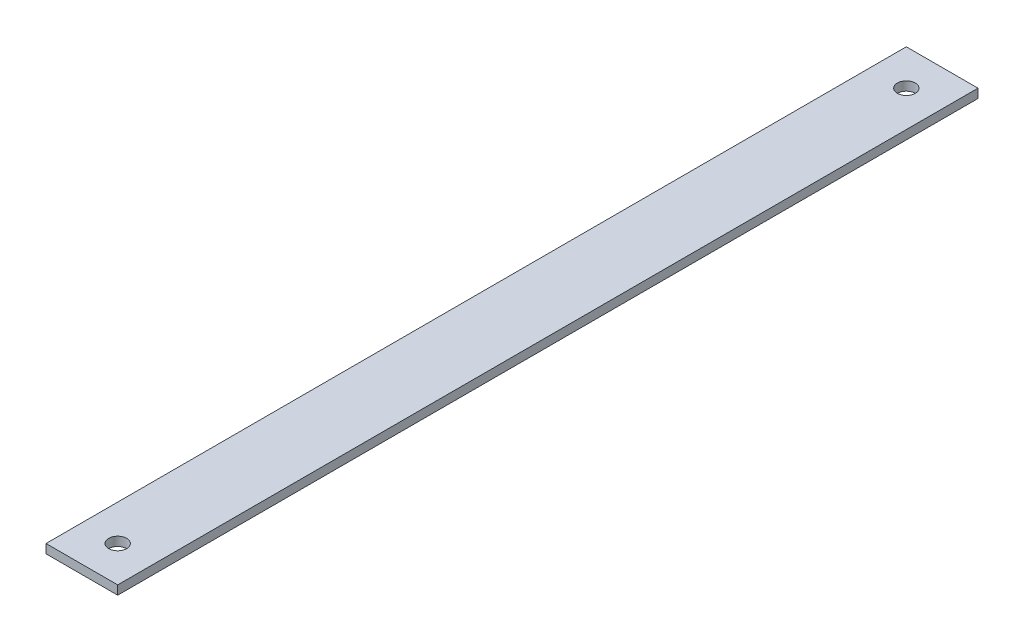
ISO-10303-21;
HEADER;
FILE_DESCRIPTION(('STEP AP214'),'2;1');
FILE_NAME('part.step','',(''),(''),'','','');
FILE_SCHEMA(('AUTOMOTIVE_DESIGN { 1 0 10303 214 1 1 1 1 }'));
ENDSEC;
DATA;
#1=APPLICATION_CONTEXT('core data for automotive mechanical design processes');
#2=APPLICATION_PROTOCOL_DEFINITION('international standard','automotive_design',2000,#1);
#3=PRODUCT_CONTEXT('',#1,'mechanical');
#4=PRODUCT('Part','Part','',(#3));
#5=PRODUCT_RELATED_PRODUCT_CATEGORY('part','',(#4));
#6=PRODUCT_DEFINITION_FORMATION('','',#4);
#7=PRODUCT_DEFINITION_CONTEXT('part definition',#1,'design');
#8=PRODUCT_DEFINITION('design','',#6,#7);
#9=PRODUCT_DEFINITION_SHAPE('','',#8);
#10=(LENGTH_UNIT() NAMED_UNIT(*) SI_UNIT(.MILLI.,.METRE.));
#11=(NAMED_UNIT(*) PLANE_ANGLE_UNIT() SI_UNIT($,.RADIAN.));
#12=(NAMED_UNIT(*) SI_UNIT($,.STERADIAN.) SOLID_ANGLE_UNIT());
#13=UNCERTAINTY_MEASURE_WITH_UNIT(LENGTH_MEASURE(1.E-05),#10,'distance_accuracy_value','');
#14=(GEOMETRIC_REPRESENTATION_CONTEXT(3) GLOBAL_UNCERTAINTY_ASSIGNED_CONTEXT((#13)) GLOBAL_UNIT_ASSIGNED_CONTEXT((#10,
#11,#12)) REPRESENTATION_CONTEXT('',''));
#15=CARTESIAN_POINT('',(0.,0.,0.));
#16=DIRECTION('',(0.,0.,1.));
#17=DIRECTION('',(1.,0.,0.));
#18=AXIS2_PLACEMENT_3D('',#15,#16,#17);
#19=CARTESIAN_POINT('',(-25.4,6.35,304.8));
#20=DIRECTION('',(1.,0.,0.));
#21=DIRECTION('',(0.,0.,-1.));
#22=AXIS2_PLACEMENT_3D('',#19,#20,#21);
#23=PLANE('',#22);
#24=DIRECTION('',(0.,0.,1.));
#25=VECTOR('',#24,1.);
#26=CARTESIAN_POINT('',(-25.4,0.,304.8));
#27=LINE('',#26,#25);
#28=CARTESIAN_POINT('',(-25.4,0.,-304.8));
#29=VERTEX_POINT('',#28);
#30=CARTESIAN_POINT('',(-25.4,0.,304.8));
#31=VERTEX_POINT('',#30);
#32=EDGE_CURVE('E96',#29,#31,#27,.T.);
#33=ORIENTED_EDGE('',*,*,#32,.T.);
#34=DIRECTION('',(0.,-1.,0.));
#35=VECTOR('',#34,1.);
#36=CARTESIAN_POINT('',(-25.4,6.35,304.8));
#37=LINE('',#36,#35);
#38=CARTESIAN_POINT('',(-25.4,6.35,304.8));
#39=VERTEX_POINT('',#38);
#40=EDGE_CURVE('E11',#39,#31,#37,.T.);
#41=ORIENTED_EDGE('',*,*,#40,.F.);
#42=DIRECTION('',(0.,0.,1.));
#43=VECTOR('',#42,1.);
#44=CARTESIAN_POINT('',(-25.4,6.35,304.8));
#45=LINE('',#44,#43);
#46=CARTESIAN_POINT('',(-25.4,6.35,-304.8));
#47=VERTEX_POINT('',#46);
#48=EDGE_CURVE('E84',#47,#39,#45,.T.);
#49=ORIENTED_EDGE('',*,*,#48,.F.);
#50=DIRECTION('',(0.,-1.,0.));
#51=VECTOR('',#50,1.);
#52=CARTESIAN_POINT('',(-25.4,6.35,-304.8));
#53=LINE('',#52,#51);
#54=EDGE_CURVE('E92',#47,#29,#53,.T.);
#55=ORIENTED_EDGE('',*,*,#54,.T.);
#56=EDGE_LOOP('',(#33,#41,#49,#55));
#57=FACE_BOUND('',#56,.T.);
#58=ADVANCED_FACE('F33',(#57),#23,.F.);
#59=CARTESIAN_POINT('',(25.4,6.35,304.8));
#60=DIRECTION('',(0.,0.,-1.));
#61=DIRECTION('',(-1.,0.,0.));
#62=AXIS2_PLACEMENT_3D('',#59,#60,#61);
#63=PLANE('',#62);
#64=DIRECTION('',(1.,0.,0.));
#65=VECTOR('',#64,1.);
#66=CARTESIAN_POINT('',(25.4,0.,304.8));
#67=LINE('',#66,#65);
#68=CARTESIAN_POINT('',(25.4,0.,304.8));
#69=VERTEX_POINT('',#68);
#70=EDGE_CURVE('E88',#31,#69,#67,.T.);
#71=ORIENTED_EDGE('',*,*,#70,.T.);
#72=DIRECTION('',(0.,-1.,0.));
#73=VECTOR('',#72,1.);
#74=CARTESIAN_POINT('',(25.4,6.35,304.8));
#75=LINE('',#74,#73);
#76=CARTESIAN_POINT('',(25.4,6.35,304.8));
#77=VERTEX_POINT('',#76);
#78=EDGE_CURVE('E41',#77,#69,#75,.T.);
#79=ORIENTED_EDGE('',*,*,#78,.F.);
#80=DIRECTION('',(1.,0.,0.));
#81=VECTOR('',#80,1.);
#82=CARTESIAN_POINT('',(25.4,6.35,304.8));
#83=LINE('',#82,#81);
#84=EDGE_CURVE('E79',#39,#77,#83,.T.);
#85=ORIENTED_EDGE('',*,*,#84,.F.);
#86=ORIENTED_EDGE('',*,*,#40,.T.);
#87=EDGE_LOOP('',(#71,#79,#85,#86));
#88=FACE_BOUND('',#87,.T.);
#89=ADVANCED_FACE('F87',(#88),#63,.F.);
#90=CARTESIAN_POINT('',(25.4,6.35,304.8));
#91=DIRECTION('',(-1.,0.,0.));
#92=DIRECTION('',(0.,0.,1.));
#93=AXIS2_PLACEMENT_3D('',#90,#91,#92);
#94=PLANE('',#93);
#95=DIRECTION('',(0.,0.,-1.));
#96=VECTOR('',#95,1.);
#97=CARTESIAN_POINT('',(25.4,0.,304.8));
#98=LINE('',#97,#96);
#99=CARTESIAN_POINT('',(25.4,0.,-304.8));
#100=VERTEX_POINT('',#99);
#101=EDGE_CURVE('E66',#69,#100,#98,.T.);
#102=ORIENTED_EDGE('',*,*,#101,.T.);
#103=DIRECTION('',(0.,-1.,0.));
#104=VECTOR('',#103,1.);
#105=CARTESIAN_POINT('',(25.4,6.35,-304.8));
#106=LINE('',#105,#104);
#107=CARTESIAN_POINT('',(25.4,6.35,-304.8));
#108=VERTEX_POINT('',#107);
#109=EDGE_CURVE('E89',#108,#100,#106,.T.);
#110=ORIENTED_EDGE('',*,*,#109,.F.);
#111=DIRECTION('',(0.,0.,-1.));
#112=VECTOR('',#111,1.);
#113=CARTESIAN_POINT('',(25.4,6.35,304.8));
#114=LINE('',#113,#112);
#115=EDGE_CURVE('E82',#77,#108,#114,.T.);
#116=ORIENTED_EDGE('',*,*,#115,.F.);
#117=ORIENTED_EDGE('',*,*,#78,.T.);
#118=EDGE_LOOP('',(#102,#110,#116,#117));
#119=FACE_BOUND('',#118,.T.);
#120=ADVANCED_FACE('F90',(#119),#94,.F.);
#121=CARTESIAN_POINT('',(25.4,6.35,-304.8));
#122=DIRECTION('',(0.,0.,1.));
#123=DIRECTION('',(1.,0.,0.));
#124=AXIS2_PLACEMENT_3D('',#121,#122,#123);
#125=PLANE('',#124);
#126=DIRECTION('',(-1.,0.,0.));
#127=VECTOR('',#126,1.);
#128=CARTESIAN_POINT('',(25.4,0.,-304.8));
#129=LINE('',#128,#127);
#130=EDGE_CURVE('E72',#100,#29,#129,.T.);
#131=ORIENTED_EDGE('',*,*,#130,.T.);
#132=ORIENTED_EDGE('',*,*,#54,.F.);
#133=DIRECTION('',(-1.,0.,0.));
#134=VECTOR('',#133,1.);
#135=CARTESIAN_POINT('',(25.4,6.35,-304.8));
#136=LINE('',#135,#134);
#137=EDGE_CURVE('E49',#108,#47,#136,.T.);
#138=ORIENTED_EDGE('',*,*,#137,.F.);
#139=ORIENTED_EDGE('',*,*,#109,.T.);
#140=EDGE_LOOP('',(#131,#132,#138,#139));
#141=FACE_BOUND('',#140,.T.);
#142=ADVANCED_FACE('F104',(#141),#125,.F.);
#143=CARTESIAN_POINT('',(0.,6.35,0.));
#144=DIRECTION('',(0.,1.,0.));
#145=DIRECTION('',(0.,0.,1.));
#146=AXIS2_PLACEMENT_3D('',#143,#144,#145);
#147=PLANE('',#146);
#148=CARTESIAN_POINT('',(-1.02649894704531E-13,6.35,-279.4));
#149=DIRECTION('',(0.,1.,0.));
#150=DIRECTION('',(0.,0.,1.));
#151=AXIS2_PLACEMENT_3D('',#148,#149,#150);
#152=CIRCLE('',#151,6.35);
#153=CARTESIAN_POINT('',(-1.02649894704531E-13,6.35,-273.05));
#154=VERTEX_POINT('',#153);
#155=EDGE_CURVE('E116',#154,#154,#152,.T.);
#156=ORIENTED_EDGE('',*,*,#155,.F.);
#157=EDGE_LOOP('',(#156));
#158=FACE_BOUND('',#157,.T.);
#159=CARTESIAN_POINT('',(0.,6.35,279.4));
#160=DIRECTION('',(0.,1.,0.));
#161=DIRECTION('',(0.,0.,1.));
#162=AXIS2_PLACEMENT_3D('',#159,#160,#161);
#163=CIRCLE('',#162,6.35);
#164=CARTESIAN_POINT('',(0.,6.35,285.75));
#165=VERTEX_POINT('',#164);
#166=EDGE_CURVE('E110',#165,#165,#163,.T.);
#167=ORIENTED_EDGE('',*,*,#166,.F.);
#168=EDGE_LOOP('',(#167));
#169=FACE_BOUND('',#168,.T.);
#170=ORIENTED_EDGE('',*,*,#48,.T.);
#171=ORIENTED_EDGE('',*,*,#84,.T.);
#172=ORIENTED_EDGE('',*,*,#115,.T.);
#173=ORIENTED_EDGE('',*,*,#137,.T.);
#174=EDGE_LOOP('',(#170,#171,#172,#173));
#175=FACE_BOUND('',#174,.T.);
#176=ADVANCED_FACE('F80',(#158,#169,#175),#147,.T.);
#177=CARTESIAN_POINT('',(0.,0.,0.));
#178=DIRECTION('',(0.,1.,0.));
#179=DIRECTION('',(0.,0.,1.));
#180=AXIS2_PLACEMENT_3D('',#177,#178,#179);
#181=PLANE('',#180);
#182=CARTESIAN_POINT('',(-1.02649894704531E-13,0.,-279.4));
#183=DIRECTION('',(0.,1.,0.));
#184=DIRECTION('',(0.,0.,1.));
#185=AXIS2_PLACEMENT_3D('',#182,#183,#184);
#186=CIRCLE('',#185,6.35);
#187=CARTESIAN_POINT('',(-1.02649894704531E-13,0.,-273.05));
#188=VERTEX_POINT('',#187);
#189=EDGE_CURVE('E99',#188,#188,#186,.T.);
#190=ORIENTED_EDGE('',*,*,#189,.T.);
#191=EDGE_LOOP('',(#190));
#192=FACE_BOUND('',#191,.T.);
#193=CARTESIAN_POINT('',(0.,0.,279.4));
#194=DIRECTION('',(0.,1.,0.));
#195=DIRECTION('',(0.,0.,1.));
#196=AXIS2_PLACEMENT_3D('',#193,#194,#195);
#197=CIRCLE('',#196,6.35);
#198=CARTESIAN_POINT('',(0.,0.,285.75));
#199=VERTEX_POINT('',#198);
#200=EDGE_CURVE('E113',#199,#199,#197,.T.);
#201=ORIENTED_EDGE('',*,*,#200,.T.);
#202=EDGE_LOOP('',(#201));
#203=FACE_BOUND('',#202,.T.);
#204=ORIENTED_EDGE('',*,*,#32,.F.);
#205=ORIENTED_EDGE('',*,*,#130,.F.);
#206=ORIENTED_EDGE('',*,*,#101,.F.);
#207=ORIENTED_EDGE('',*,*,#70,.F.);
#208=EDGE_LOOP('',(#204,#205,#206,#207));
#209=FACE_BOUND('',#208,.T.);
#210=ADVANCED_FACE('F107',(#192,#203,#209),#181,.F.);
#211=CARTESIAN_POINT('',(0.,0.,279.4));
#212=DIRECTION('',(0.,1.,0.));
#213=DIRECTION('',(0.,0.,1.));
#214=AXIS2_PLACEMENT_3D('',#211,#212,#213);
#215=CYLINDRICAL_SURFACE('',#214,6.35);
#216=ORIENTED_EDGE('',*,*,#200,.F.);
#217=EDGE_LOOP('',(#216));
#218=FACE_BOUND('',#217,.T.);
#219=ORIENTED_EDGE('',*,*,#166,.T.);
#220=EDGE_LOOP('',(#219));
#221=FACE_BOUND('',#220,.T.);
#222=ADVANCED_FACE('F127',(#218,#221),#215,.F.);
#223=CARTESIAN_POINT('',(-1.02649894704531E-13,0.,-279.4));
#224=DIRECTION('',(0.,1.,0.));
#225=DIRECTION('',(0.,0.,1.));
#226=AXIS2_PLACEMENT_3D('',#223,#224,#225);
#227=CYLINDRICAL_SURFACE('',#226,6.35);
#228=ORIENTED_EDGE('',*,*,#189,.F.);
#229=EDGE_LOOP('',(#228));
#230=FACE_BOUND('',#229,.T.);
#231=ORIENTED_EDGE('',*,*,#155,.T.);
#232=EDGE_LOOP('',(#231));
#233=FACE_BOUND('',#232,.T.);
#234=ADVANCED_FACE('F124',(#230,#233),#227,.F.);
#235=CLOSED_SHELL('',(#58,#89,#120,#142,#176,#210,#222,#234));
#236=MANIFOLD_SOLID_BREP('B2',#235);
#237=ADVANCED_BREP_SHAPE_REPRESENTATION('',(#18,#236),#14);
#238=SHAPE_DEFINITION_REPRESENTATION(#9,#237);
ENDSEC;
END-ISO-10303-21;
